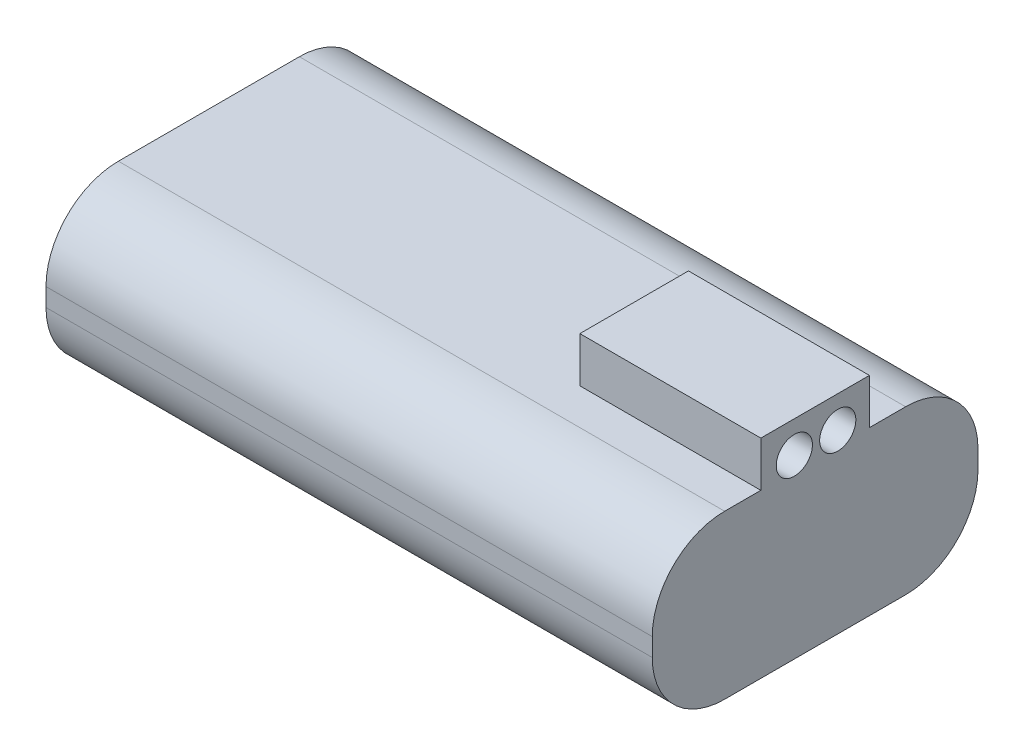
ISO-10303-21;
HEADER;
FILE_DESCRIPTION(('STEP AP214'),'2;1');
FILE_NAME('part.step','',(''),(''),'','','');
FILE_SCHEMA(('AUTOMOTIVE_DESIGN { 1 0 10303 214 1 1 1 1 }'));
ENDSEC;
DATA;
#1=APPLICATION_CONTEXT('core data for automotive mechanical design processes');
#2=APPLICATION_PROTOCOL_DEFINITION('international standard','automotive_design',2000,#1);
#3=PRODUCT_CONTEXT('',#1,'mechanical');
#4=PRODUCT('Part','Part','',(#3));
#5=PRODUCT_RELATED_PRODUCT_CATEGORY('part','',(#4));
#6=PRODUCT_DEFINITION_FORMATION('','',#4);
#7=PRODUCT_DEFINITION_CONTEXT('part definition',#1,'design');
#8=PRODUCT_DEFINITION('design','',#6,#7);
#9=PRODUCT_DEFINITION_SHAPE('','',#8);
#10=(LENGTH_UNIT() NAMED_UNIT(*) SI_UNIT(.MILLI.,.METRE.));
#11=(NAMED_UNIT(*) PLANE_ANGLE_UNIT() SI_UNIT($,.RADIAN.));
#12=(NAMED_UNIT(*) SI_UNIT($,.STERADIAN.) SOLID_ANGLE_UNIT());
#13=UNCERTAINTY_MEASURE_WITH_UNIT(LENGTH_MEASURE(1.E-05),#10,'distance_accuracy_value','');
#14=(GEOMETRIC_REPRESENTATION_CONTEXT(3) GLOBAL_UNCERTAINTY_ASSIGNED_CONTEXT((#13)) GLOBAL_UNIT_ASSIGNED_CONTEXT((#10,
#11,#12)) REPRESENTATION_CONTEXT('',''));
#15=CARTESIAN_POINT('',(0.,0.,0.));
#16=DIRECTION('',(0.,0.,1.));
#17=DIRECTION('',(1.,0.,0.));
#18=AXIS2_PLACEMENT_3D('',#15,#16,#17);
#19=CARTESIAN_POINT('',(0.,18.,0.));
#20=DIRECTION('',(0.,-1.,0.));
#21=DIRECTION('',(0.,0.,-1.));
#22=AXIS2_PLACEMENT_3D('',#19,#20,#21);
#23=PLANE('',#22);
#24=DIRECTION('',(0.,0.,-1.));
#25=VECTOR('',#24,1.);
#26=CARTESIAN_POINT('',(33.5,18.,18.));
#27=LINE('',#26,#25);
#28=CARTESIAN_POINT('',(33.5,18.,-6.));
#29=VERTEX_POINT('',#28);
#30=CARTESIAN_POINT('',(33.5,18.,-9.99999999999999));
#31=VERTEX_POINT('',#30);
#32=EDGE_CURVE('E167',#29,#31,#27,.T.);
#33=ORIENTED_EDGE('',*,*,#32,.T.);
#34=DIRECTION('',(-1.,0.,0.));
#35=VECTOR('',#34,1.);
#36=CARTESIAN_POINT('',(0.,18.,-9.99999999999999));
#37=LINE('',#36,#35);
#38=CARTESIAN_POINT('',(-33.5,18.,-9.99999999999999));
#39=VERTEX_POINT('',#38);
#40=EDGE_CURVE('E209',#31,#39,#37,.T.);
#41=ORIENTED_EDGE('',*,*,#40,.T.);
#42=DIRECTION('',(0.,0.,1.));
#43=VECTOR('',#42,1.);
#44=CARTESIAN_POINT('',(-33.5,18.,18.));
#45=LINE('',#44,#43);
#46=CARTESIAN_POINT('',(-33.5,18.,10.));
#47=VERTEX_POINT('',#46);
#48=EDGE_CURVE('E166',#39,#47,#45,.T.);
#49=ORIENTED_EDGE('',*,*,#48,.T.);
#50=DIRECTION('',(1.,0.,0.));
#51=VECTOR('',#50,1.);
#52=CARTESIAN_POINT('',(0.,18.,10.));
#53=LINE('',#52,#51);
#54=CARTESIAN_POINT('',(33.5,18.,10.));
#55=VERTEX_POINT('',#54);
#56=EDGE_CURVE('E206',#47,#55,#53,.T.);
#57=ORIENTED_EDGE('',*,*,#56,.T.);
#58=CARTESIAN_POINT('',(33.5,18.,6.));
#59=VERTEX_POINT('',#58);
#60=EDGE_CURVE('E164',#55,#59,#27,.T.);
#61=ORIENTED_EDGE('',*,*,#60,.T.);
#62=DIRECTION('',(1.,0.,0.));
#63=VECTOR('',#62,1.);
#64=CARTESIAN_POINT('',(13.5,18.,6.));
#65=LINE('',#64,#63);
#66=CARTESIAN_POINT('',(13.5,18.,6.));
#67=VERTEX_POINT('',#66);
#68=EDGE_CURVE('E233',#67,#59,#65,.T.);
#69=ORIENTED_EDGE('',*,*,#68,.F.);
#70=DIRECTION('',(0.,0.,1.));
#71=VECTOR('',#70,1.);
#72=CARTESIAN_POINT('',(13.5,18.,-6.));
#73=LINE('',#72,#71);
#74=CARTESIAN_POINT('',(13.5,18.,-6.));
#75=VERTEX_POINT('',#74);
#76=EDGE_CURVE('E154',#75,#67,#73,.T.);
#77=ORIENTED_EDGE('',*,*,#76,.F.);
#78=DIRECTION('',(-1.,0.,0.));
#79=VECTOR('',#78,1.);
#80=CARTESIAN_POINT('',(13.5,18.,-6.));
#81=LINE('',#80,#79);
#82=EDGE_CURVE('E151',#29,#75,#81,.T.);
#83=ORIENTED_EDGE('',*,*,#82,.F.);
#84=EDGE_LOOP('',(#33,#41,#49,#57,#61,#69,#77,#83));
#85=FACE_BOUND('',#84,.T.);
#86=ADVANCED_FACE('F40',(#85),#23,.F.);
#87=CARTESIAN_POINT('',(33.5,18.,18.));
#88=DIRECTION('',(-1.,0.,0.));
#89=DIRECTION('',(0.,0.,1.));
#90=AXIS2_PLACEMENT_3D('',#87,#88,#89);
#91=PLANE('',#90);
#92=CARTESIAN_POINT('',(33.5,19.5,-2.5));
#93=DIRECTION('',(1.,0.,0.));
#94=DIRECTION('',(0.,0.,-1.));
#95=AXIS2_PLACEMENT_3D('',#92,#93,#94);
#96=CIRCLE('',#95,2.);
#97=CARTESIAN_POINT('',(33.5,19.5,-4.5));
#98=VERTEX_POINT('',#97);
#99=EDGE_CURVE('E476',#98,#98,#96,.T.);
#100=ORIENTED_EDGE('',*,*,#99,.F.);
#101=EDGE_LOOP('',(#100));
#102=FACE_BOUND('',#101,.T.);
#103=CARTESIAN_POINT('',(33.5,19.5,2.3));
#104=DIRECTION('',(1.,0.,0.));
#105=DIRECTION('',(0.,0.,-1.));
#106=AXIS2_PLACEMENT_3D('',#103,#104,#105);
#107=CIRCLE('',#106,2.);
#108=CARTESIAN_POINT('',(33.5,19.5,0.299999999999996));
#109=VERTEX_POINT('',#108);
#110=EDGE_CURVE('E479',#109,#109,#107,.T.);
#111=ORIENTED_EDGE('',*,*,#110,.F.);
#112=EDGE_LOOP('',(#111));
#113=FACE_BOUND('',#112,.T.);
#114=DIRECTION('',(0.,0.,-1.));
#115=VECTOR('',#114,1.);
#116=CARTESIAN_POINT('',(33.5,0.,18.));
#117=LINE('',#116,#115);
#118=CARTESIAN_POINT('',(33.5,0.,10.));
#119=VERTEX_POINT('',#118);
#120=CARTESIAN_POINT('',(33.5,0.,-9.99999999999999));
#121=VERTEX_POINT('',#120);
#122=EDGE_CURVE('E155',#119,#121,#117,.T.);
#123=ORIENTED_EDGE('',*,*,#122,.T.);
#124=CARTESIAN_POINT('',(33.5,8.,-9.99999999999999));
#125=DIRECTION('',(-1.,0.,0.));
#126=DIRECTION('',(0.,0.,1.));
#127=AXIS2_PLACEMENT_3D('',#124,#125,#126);
#128=CIRCLE('',#127,8.);
#129=CARTESIAN_POINT('',(33.5,8.,-18.));
#130=VERTEX_POINT('',#129);
#131=EDGE_CURVE('E204',#121,#130,#128,.F.);
#132=ORIENTED_EDGE('',*,*,#131,.T.);
#133=DIRECTION('',(0.,-1.,0.));
#134=VECTOR('',#133,1.);
#135=CARTESIAN_POINT('',(33.5,18.,-18.));
#136=LINE('',#135,#134);
#137=CARTESIAN_POINT('',(33.5,10.,-18.));
#138=VERTEX_POINT('',#137);
#139=EDGE_CURVE('E180',#138,#130,#136,.T.);
#140=ORIENTED_EDGE('',*,*,#139,.F.);
#141=CARTESIAN_POINT('',(33.5,10.,-9.99999999999999));
#142=DIRECTION('',(-1.,0.,0.));
#143=DIRECTION('',(0.,0.,1.));
#144=AXIS2_PLACEMENT_3D('',#141,#142,#143);
#145=CIRCLE('',#144,8.);
#146=EDGE_CURVE('E202',#138,#31,#145,.F.);
#147=ORIENTED_EDGE('',*,*,#146,.T.);
#148=ORIENTED_EDGE('',*,*,#32,.F.);
#149=DIRECTION('',(0.,-1.,0.));
#150=VECTOR('',#149,1.);
#151=CARTESIAN_POINT('',(33.5,23.,-6.));
#152=LINE('',#151,#150);
#153=CARTESIAN_POINT('',(33.5,23.,-6.));
#154=VERTEX_POINT('',#153);
#155=EDGE_CURVE('E160',#154,#29,#152,.T.);
#156=ORIENTED_EDGE('',*,*,#155,.F.);
#157=DIRECTION('',(0.,0.,-1.));
#158=VECTOR('',#157,1.);
#159=CARTESIAN_POINT('',(33.5,23.,-6.));
#160=LINE('',#159,#158);
#161=CARTESIAN_POINT('',(33.5,23.,6.));
#162=VERTEX_POINT('',#161);
#163=EDGE_CURVE('E141',#162,#154,#160,.T.);
#164=ORIENTED_EDGE('',*,*,#163,.F.);
#165=DIRECTION('',(0.,-1.,0.));
#166=VECTOR('',#165,1.);
#167=CARTESIAN_POINT('',(33.5,23.,6.));
#168=LINE('',#167,#166);
#169=EDGE_CURVE('E138',#162,#59,#168,.T.);
#170=ORIENTED_EDGE('',*,*,#169,.T.);
#171=ORIENTED_EDGE('',*,*,#60,.F.);
#172=CARTESIAN_POINT('',(33.5,10.,10.));
#173=DIRECTION('',(-1.,0.,0.));
#174=DIRECTION('',(0.,0.,1.));
#175=AXIS2_PLACEMENT_3D('',#172,#173,#174);
#176=CIRCLE('',#175,8.);
#177=CARTESIAN_POINT('',(33.5,10.,18.));
#178=VERTEX_POINT('',#177);
#179=EDGE_CURVE('E62',#55,#178,#176,.F.);
#180=ORIENTED_EDGE('',*,*,#179,.T.);
#181=DIRECTION('',(0.,-1.,0.));
#182=VECTOR('',#181,1.);
#183=CARTESIAN_POINT('',(33.5,18.,18.));
#184=LINE('',#183,#182);
#185=CARTESIAN_POINT('',(33.5,8.,18.));
#186=VERTEX_POINT('',#185);
#187=EDGE_CURVE('E169',#178,#186,#184,.T.);
#188=ORIENTED_EDGE('',*,*,#187,.T.);
#189=CARTESIAN_POINT('',(33.5,8.,10.));
#190=DIRECTION('',(-1.,0.,0.));
#191=DIRECTION('',(0.,0.,1.));
#192=AXIS2_PLACEMENT_3D('',#189,#190,#191);
#193=CIRCLE('',#192,8.);
#194=EDGE_CURVE('E55',#186,#119,#193,.F.);
#195=ORIENTED_EDGE('',*,*,#194,.T.);
#196=EDGE_LOOP('',(#123,#132,#140,#147,#148,#156,#164,#170,#171,#180,#188,#195));
#197=FACE_BOUND('',#196,.T.);
#198=ADVANCED_FACE('F224',(#102,#113,#197),#91,.F.);
#199=CARTESIAN_POINT('',(-33.5,18.,-18.));
#200=DIRECTION('',(0.,0.,1.));
#201=DIRECTION('',(1.,0.,0.));
#202=AXIS2_PLACEMENT_3D('',#199,#200,#201);
#203=PLANE('',#202);
#204=ORIENTED_EDGE('',*,*,#139,.T.);
#205=DIRECTION('',(-1.,0.,0.));
#206=VECTOR('',#205,1.);
#207=CARTESIAN_POINT('',(-33.5,8.,-18.));
#208=LINE('',#207,#206);
#209=CARTESIAN_POINT('',(-33.5,8.,-18.));
#210=VERTEX_POINT('',#209);
#211=EDGE_CURVE('E185',#130,#210,#208,.T.);
#212=ORIENTED_EDGE('',*,*,#211,.T.);
#213=DIRECTION('',(0.,-1.,0.));
#214=VECTOR('',#213,1.);
#215=CARTESIAN_POINT('',(-33.5,18.,-18.));
#216=LINE('',#215,#214);
#217=CARTESIAN_POINT('',(-33.5,10.,-18.));
#218=VERTEX_POINT('',#217);
#219=EDGE_CURVE('E177',#218,#210,#216,.T.);
#220=ORIENTED_EDGE('',*,*,#219,.F.);
#221=DIRECTION('',(-1.,0.,0.));
#222=VECTOR('',#221,1.);
#223=CARTESIAN_POINT('',(-33.5,10.,-18.));
#224=LINE('',#223,#222);
#225=EDGE_CURVE('E183',#218,#138,#224,.F.);
#226=ORIENTED_EDGE('',*,*,#225,.T.);
#227=EDGE_LOOP('',(#204,#212,#220,#226));
#228=FACE_BOUND('',#227,.T.);
#229=ADVANCED_FACE('F248',(#228),#203,.F.);
#230=CARTESIAN_POINT('',(-33.5,18.,18.));
#231=DIRECTION('',(1.,0.,0.));
#232=DIRECTION('',(0.,0.,-1.));
#233=AXIS2_PLACEMENT_3D('',#230,#231,#232);
#234=PLANE('',#233);
#235=ORIENTED_EDGE('',*,*,#219,.T.);
#236=CARTESIAN_POINT('',(-33.5,8.,-9.99999999999999));
#237=DIRECTION('',(1.,0.,0.));
#238=DIRECTION('',(0.,0.,-1.));
#239=AXIS2_PLACEMENT_3D('',#236,#237,#238);
#240=CIRCLE('',#239,8.);
#241=CARTESIAN_POINT('',(-33.5,0.,-9.99999999999999));
#242=VERTEX_POINT('',#241);
#243=EDGE_CURVE('E194',#210,#242,#240,.F.);
#244=ORIENTED_EDGE('',*,*,#243,.T.);
#245=DIRECTION('',(0.,0.,1.));
#246=VECTOR('',#245,1.);
#247=CARTESIAN_POINT('',(-33.5,0.,18.));
#248=LINE('',#247,#246);
#249=CARTESIAN_POINT('',(-33.5,0.,10.));
#250=VERTEX_POINT('',#249);
#251=EDGE_CURVE('E158',#242,#250,#248,.T.);
#252=ORIENTED_EDGE('',*,*,#251,.T.);
#253=CARTESIAN_POINT('',(-33.5,8.,10.));
#254=DIRECTION('',(1.,0.,0.));
#255=DIRECTION('',(0.,0.,-1.));
#256=AXIS2_PLACEMENT_3D('',#253,#254,#255);
#257=CIRCLE('',#256,8.);
#258=CARTESIAN_POINT('',(-33.5,8.,18.));
#259=VERTEX_POINT('',#258);
#260=EDGE_CURVE('E190',#250,#259,#257,.F.);
#261=ORIENTED_EDGE('',*,*,#260,.T.);
#262=DIRECTION('',(0.,-1.,0.));
#263=VECTOR('',#262,1.);
#264=CARTESIAN_POINT('',(-33.5,18.,18.));
#265=LINE('',#264,#263);
#266=CARTESIAN_POINT('',(-33.5,10.,18.));
#267=VERTEX_POINT('',#266);
#268=EDGE_CURVE('E174',#267,#259,#265,.T.);
#269=ORIENTED_EDGE('',*,*,#268,.F.);
#270=CARTESIAN_POINT('',(-33.5,10.,10.));
#271=DIRECTION('',(1.,0.,0.));
#272=DIRECTION('',(0.,0.,-1.));
#273=AXIS2_PLACEMENT_3D('',#270,#271,#272);
#274=CIRCLE('',#273,8.);
#275=EDGE_CURVE('E188',#267,#47,#274,.F.);
#276=ORIENTED_EDGE('',*,*,#275,.T.);
#277=ORIENTED_EDGE('',*,*,#48,.F.);
#278=CARTESIAN_POINT('',(-33.5,10.,-9.99999999999999));
#279=DIRECTION('',(1.,0.,0.));
#280=DIRECTION('',(0.,0.,-1.));
#281=AXIS2_PLACEMENT_3D('',#278,#279,#280);
#282=CIRCLE('',#281,8.);
#283=EDGE_CURVE('E192',#39,#218,#282,.F.);
#284=ORIENTED_EDGE('',*,*,#283,.T.);
#285=EDGE_LOOP('',(#235,#244,#252,#261,#269,#276,#277,#284));
#286=FACE_BOUND('',#285,.T.);
#287=ADVANCED_FACE('F218',(#286),#234,.F.);
#288=CARTESIAN_POINT('',(-33.5,18.,18.));
#289=DIRECTION('',(0.,0.,-1.));
#290=DIRECTION('',(-1.,0.,0.));
#291=AXIS2_PLACEMENT_3D('',#288,#289,#290);
#292=PLANE('',#291);
#293=ORIENTED_EDGE('',*,*,#268,.T.);
#294=DIRECTION('',(1.,0.,0.));
#295=VECTOR('',#294,1.);
#296=CARTESIAN_POINT('',(33.5,8.,18.));
#297=LINE('',#296,#295);
#298=EDGE_CURVE('E11',#259,#186,#297,.T.);
#299=ORIENTED_EDGE('',*,*,#298,.T.);
#300=ORIENTED_EDGE('',*,*,#187,.F.);
#301=DIRECTION('',(1.,0.,0.));
#302=VECTOR('',#301,1.);
#303=CARTESIAN_POINT('',(-33.5,10.,18.));
#304=LINE('',#303,#302);
#305=EDGE_CURVE('E48',#178,#267,#304,.F.);
#306=ORIENTED_EDGE('',*,*,#305,.T.);
#307=EDGE_LOOP('',(#293,#299,#300,#306));
#308=FACE_BOUND('',#307,.T.);
#309=ADVANCED_FACE('F214',(#308),#292,.F.);
#310=CARTESIAN_POINT('',(0.,0.,0.));
#311=DIRECTION('',(0.,-1.,0.));
#312=DIRECTION('',(0.,0.,-1.));
#313=AXIS2_PLACEMENT_3D('',#310,#311,#312);
#314=PLANE('',#313);
#315=ORIENTED_EDGE('',*,*,#251,.F.);
#316=DIRECTION('',(-1.,0.,0.));
#317=VECTOR('',#316,1.);
#318=CARTESIAN_POINT('',(33.5,0.,-9.99999999999999));
#319=LINE('',#318,#317);
#320=EDGE_CURVE('E198',#242,#121,#319,.F.);
#321=ORIENTED_EDGE('',*,*,#320,.T.);
#322=ORIENTED_EDGE('',*,*,#122,.F.);
#323=DIRECTION('',(1.,0.,0.));
#324=VECTOR('',#323,1.);
#325=CARTESIAN_POINT('',(-33.5,0.,10.));
#326=LINE('',#325,#324);
#327=EDGE_CURVE('E196',#119,#250,#326,.F.);
#328=ORIENTED_EDGE('',*,*,#327,.T.);
#329=EDGE_LOOP('',(#315,#321,#322,#328));
#330=FACE_BOUND('',#329,.T.);
#331=ADVANCED_FACE('F256',(#330),#314,.T.);
#332=CARTESIAN_POINT('',(13.5,23.,-6.));
#333=DIRECTION('',(1.,0.,0.));
#334=DIRECTION('',(0.,0.,-1.));
#335=AXIS2_PLACEMENT_3D('',#332,#333,#334);
#336=PLANE('',#335);
#337=ORIENTED_EDGE('',*,*,#76,.T.);
#338=DIRECTION('',(0.,-1.,0.));
#339=VECTOR('',#338,1.);
#340=CARTESIAN_POINT('',(13.5,23.,6.));
#341=LINE('',#340,#339);
#342=CARTESIAN_POINT('',(13.5,23.,6.));
#343=VERTEX_POINT('',#342);
#344=EDGE_CURVE('E135',#343,#67,#341,.T.);
#345=ORIENTED_EDGE('',*,*,#344,.F.);
#346=DIRECTION('',(0.,0.,1.));
#347=VECTOR('',#346,1.);
#348=CARTESIAN_POINT('',(13.5,23.,-6.));
#349=LINE('',#348,#347);
#350=CARTESIAN_POINT('',(13.5,23.,-6.));
#351=VERTEX_POINT('',#350);
#352=EDGE_CURVE('E142',#351,#343,#349,.T.);
#353=ORIENTED_EDGE('',*,*,#352,.F.);
#354=DIRECTION('',(0.,-1.,0.));
#355=VECTOR('',#354,1.);
#356=CARTESIAN_POINT('',(13.5,23.,-6.));
#357=LINE('',#356,#355);
#358=EDGE_CURVE('E229',#351,#75,#357,.T.);
#359=ORIENTED_EDGE('',*,*,#358,.T.);
#360=EDGE_LOOP('',(#337,#345,#353,#359));
#361=FACE_BOUND('',#360,.T.);
#362=ADVANCED_FACE('F153',(#361),#336,.F.);
#363=CARTESIAN_POINT('',(13.5,23.,6.));
#364=DIRECTION('',(0.,0.,-1.));
#365=DIRECTION('',(-1.,0.,0.));
#366=AXIS2_PLACEMENT_3D('',#363,#364,#365);
#367=PLANE('',#366);
#368=ORIENTED_EDGE('',*,*,#68,.T.);
#369=ORIENTED_EDGE('',*,*,#169,.F.);
#370=DIRECTION('',(1.,0.,0.));
#371=VECTOR('',#370,1.);
#372=CARTESIAN_POINT('',(13.5,23.,6.));
#373=LINE('',#372,#371);
#374=EDGE_CURVE('E130',#343,#162,#373,.T.);
#375=ORIENTED_EDGE('',*,*,#374,.F.);
#376=ORIENTED_EDGE('',*,*,#344,.T.);
#377=EDGE_LOOP('',(#368,#369,#375,#376));
#378=FACE_BOUND('',#377,.T.);
#379=ADVANCED_FACE('F133',(#378),#367,.F.);
#380=CARTESIAN_POINT('',(13.5,23.,-6.));
#381=DIRECTION('',(0.,0.,1.));
#382=DIRECTION('',(1.,0.,0.));
#383=AXIS2_PLACEMENT_3D('',#380,#381,#382);
#384=PLANE('',#383);
#385=ORIENTED_EDGE('',*,*,#82,.T.);
#386=ORIENTED_EDGE('',*,*,#358,.F.);
#387=DIRECTION('',(-1.,0.,0.));
#388=VECTOR('',#387,1.);
#389=CARTESIAN_POINT('',(13.5,23.,-6.));
#390=LINE('',#389,#388);
#391=EDGE_CURVE('E147',#154,#351,#390,.T.);
#392=ORIENTED_EDGE('',*,*,#391,.F.);
#393=ORIENTED_EDGE('',*,*,#155,.T.);
#394=EDGE_LOOP('',(#385,#386,#392,#393));
#395=FACE_BOUND('',#394,.T.);
#396=ADVANCED_FACE('F239',(#395),#384,.F.);
#397=CARTESIAN_POINT('',(0.,23.,0.));
#398=DIRECTION('',(0.,1.,0.));
#399=DIRECTION('',(0.,0.,1.));
#400=AXIS2_PLACEMENT_3D('',#397,#398,#399);
#401=PLANE('',#400);
#402=ORIENTED_EDGE('',*,*,#352,.T.);
#403=ORIENTED_EDGE('',*,*,#374,.T.);
#404=ORIENTED_EDGE('',*,*,#163,.T.);
#405=ORIENTED_EDGE('',*,*,#391,.T.);
#406=EDGE_LOOP('',(#402,#403,#404,#405));
#407=FACE_BOUND('',#406,.T.);
#408=ADVANCED_FACE('F145',(#407),#401,.T.);
#409=CARTESIAN_POINT('',(-33.5,8.,-9.99999999999999));
#410=DIRECTION('',(1.,0.,0.));
#411=DIRECTION('',(0.,0.,-1.));
#412=AXIS2_PLACEMENT_3D('',#409,#410,#411);
#413=CYLINDRICAL_SURFACE('',#412,8.);
#414=ORIENTED_EDGE('',*,*,#131,.F.);
#415=ORIENTED_EDGE('',*,*,#320,.F.);
#416=ORIENTED_EDGE('',*,*,#243,.F.);
#417=ORIENTED_EDGE('',*,*,#211,.F.);
#418=EDGE_LOOP('',(#414,#415,#416,#417));
#419=FACE_BOUND('',#418,.T.);
#420=ADVANCED_FACE('F252',(#419),#413,.T.);
#421=CARTESIAN_POINT('',(0.,10.,-9.99999999999999));
#422=DIRECTION('',(-1.,0.,0.));
#423=DIRECTION('',(0.,0.,1.));
#424=AXIS2_PLACEMENT_3D('',#421,#422,#423);
#425=CYLINDRICAL_SURFACE('',#424,8.);
#426=ORIENTED_EDGE('',*,*,#146,.F.);
#427=ORIENTED_EDGE('',*,*,#225,.F.);
#428=ORIENTED_EDGE('',*,*,#283,.F.);
#429=ORIENTED_EDGE('',*,*,#40,.F.);
#430=EDGE_LOOP('',(#426,#427,#428,#429));
#431=FACE_BOUND('',#430,.T.);
#432=ADVANCED_FACE('F245',(#431),#425,.T.);
#433=CARTESIAN_POINT('',(-33.5,8.,10.));
#434=DIRECTION('',(-1.,0.,0.));
#435=DIRECTION('',(0.,0.,1.));
#436=AXIS2_PLACEMENT_3D('',#433,#434,#435);
#437=CYLINDRICAL_SURFACE('',#436,8.);
#438=ORIENTED_EDGE('',*,*,#260,.F.);
#439=ORIENTED_EDGE('',*,*,#327,.F.);
#440=ORIENTED_EDGE('',*,*,#194,.F.);
#441=ORIENTED_EDGE('',*,*,#298,.F.);
#442=EDGE_LOOP('',(#438,#439,#440,#441));
#443=FACE_BOUND('',#442,.T.);
#444=ADVANCED_FACE('F258',(#443),#437,.T.);
#445=CARTESIAN_POINT('',(0.,10.,10.));
#446=DIRECTION('',(1.,0.,0.));
#447=DIRECTION('',(0.,0.,-1.));
#448=AXIS2_PLACEMENT_3D('',#445,#446,#447);
#449=CYLINDRICAL_SURFACE('',#448,8.);
#450=ORIENTED_EDGE('',*,*,#275,.F.);
#451=ORIENTED_EDGE('',*,*,#305,.F.);
#452=ORIENTED_EDGE('',*,*,#179,.F.);
#453=ORIENTED_EDGE('',*,*,#56,.F.);
#454=EDGE_LOOP('',(#450,#451,#452,#453));
#455=FACE_BOUND('',#454,.T.);
#456=ADVANCED_FACE('F42',(#455),#449,.T.);
#457=CARTESIAN_POINT('',(28.5,19.5,2.3));
#458=DIRECTION('',(1.,0.,0.));
#459=DIRECTION('',(0.,0.,-1.));
#460=AXIS2_PLACEMENT_3D('',#457,#458,#459);
#461=CYLINDRICAL_SURFACE('',#460,2.);
#462=CARTESIAN_POINT('',(28.5,19.5,2.3));
#463=DIRECTION('',(1.,0.,0.));
#464=DIRECTION('',(0.,0.,-1.));
#465=AXIS2_PLACEMENT_3D('',#462,#463,#464);
#466=CIRCLE('',#465,2.);
#467=CARTESIAN_POINT('',(28.5,19.5,0.299999999999996));
#468=VERTEX_POINT('',#467);
#469=EDGE_CURVE('E484',#468,#468,#466,.T.);
#470=ORIENTED_EDGE('',*,*,#469,.F.);
#471=EDGE_LOOP('',(#470));
#472=FACE_BOUND('',#471,.T.);
#473=ORIENTED_EDGE('',*,*,#110,.T.);
#474=EDGE_LOOP('',(#473));
#475=FACE_BOUND('',#474,.T.);
#476=ADVANCED_FACE('F264',(#472,#475),#461,.F.);
#477=CARTESIAN_POINT('',(28.5,19.5,2.3));
#478=DIRECTION('',(1.,0.,0.));
#479=DIRECTION('',(0.,0.,-1.));
#480=AXIS2_PLACEMENT_3D('',#477,#478,#479);
#481=PLANE('',#480);
#482=ORIENTED_EDGE('',*,*,#469,.T.);
#483=EDGE_LOOP('',(#482));
#484=FACE_BOUND('',#483,.T.);
#485=ADVANCED_FACE('F294',(#484),#481,.T.);
#486=CARTESIAN_POINT('',(28.5,19.5,-2.5));
#487=DIRECTION('',(1.,0.,0.));
#488=DIRECTION('',(0.,0.,-1.));
#489=AXIS2_PLACEMENT_3D('',#486,#487,#488);
#490=CYLINDRICAL_SURFACE('',#489,2.);
#491=CARTESIAN_POINT('',(28.5,19.5,-2.5));
#492=DIRECTION('',(1.,0.,0.));
#493=DIRECTION('',(0.,0.,-1.));
#494=AXIS2_PLACEMENT_3D('',#491,#492,#493);
#495=CIRCLE('',#494,2.);
#496=CARTESIAN_POINT('',(28.5,19.5,-4.5));
#497=VERTEX_POINT('',#496);
#498=EDGE_CURVE('E234',#497,#497,#495,.T.);
#499=ORIENTED_EDGE('',*,*,#498,.F.);
#500=EDGE_LOOP('',(#499));
#501=FACE_BOUND('',#500,.T.);
#502=ORIENTED_EDGE('',*,*,#99,.T.);
#503=EDGE_LOOP('',(#502));
#504=FACE_BOUND('',#503,.T.);
#505=ADVANCED_FACE('F443',(#501,#504),#490,.F.);
#506=CARTESIAN_POINT('',(28.5,19.5,-2.5));
#507=DIRECTION('',(1.,0.,0.));
#508=DIRECTION('',(0.,0.,-1.));
#509=AXIS2_PLACEMENT_3D('',#506,#507,#508);
#510=PLANE('',#509);
#511=ORIENTED_EDGE('',*,*,#498,.T.);
#512=EDGE_LOOP('',(#511));
#513=FACE_BOUND('',#512,.T.);
#514=ADVANCED_FACE('F452',(#513),#510,.T.);
#515=CLOSED_SHELL('',(#86,#198,#229,#287,#309,#331,#362,#379,#396,#408,#420,#432,#444,#456,#476,
#485,#505,#514));
#516=MANIFOLD_SOLID_BREP('B2',#515);
#517=ADVANCED_BREP_SHAPE_REPRESENTATION('',(#18,#516),#14);
#518=SHAPE_DEFINITION_REPRESENTATION(#9,#517);
ENDSEC;
END-ISO-10303-21;
